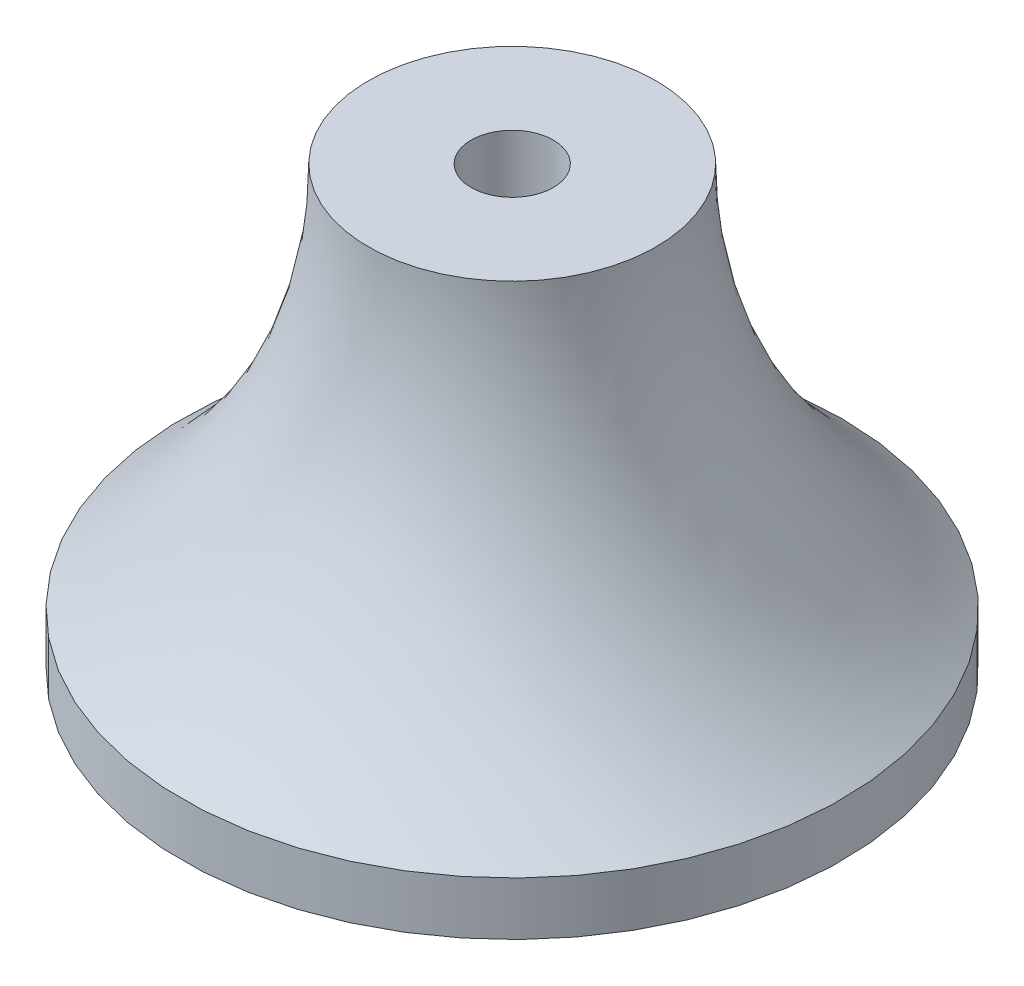
ISO-10303-21;
HEADER;
FILE_DESCRIPTION(('STEP AP214'),'2;1');
FILE_NAME('part.step','',(''),(''),'','','');
FILE_SCHEMA(('AUTOMOTIVE_DESIGN { 1 0 10303 214 1 1 1 1 }'));
ENDSEC;
DATA;
#1=APPLICATION_CONTEXT('core data for automotive mechanical design processes');
#2=APPLICATION_PROTOCOL_DEFINITION('international standard','automotive_design',2000,#1);
#3=PRODUCT_CONTEXT('',#1,'mechanical');
#4=PRODUCT('Part','Part','',(#3));
#5=PRODUCT_RELATED_PRODUCT_CATEGORY('part','',(#4));
#6=PRODUCT_DEFINITION_FORMATION('','',#4);
#7=PRODUCT_DEFINITION_CONTEXT('part definition',#1,'design');
#8=PRODUCT_DEFINITION('design','',#6,#7);
#9=PRODUCT_DEFINITION_SHAPE('','',#8);
#10=(LENGTH_UNIT() NAMED_UNIT(*) SI_UNIT(.MILLI.,.METRE.));
#11=(NAMED_UNIT(*) PLANE_ANGLE_UNIT() SI_UNIT($,.RADIAN.));
#12=(NAMED_UNIT(*) SI_UNIT($,.STERADIAN.) SOLID_ANGLE_UNIT());
#13=UNCERTAINTY_MEASURE_WITH_UNIT(LENGTH_MEASURE(1.E-05),#10,'distance_accuracy_value','');
#14=(GEOMETRIC_REPRESENTATION_CONTEXT(3) GLOBAL_UNCERTAINTY_ASSIGNED_CONTEXT((#13)) GLOBAL_UNIT_ASSIGNED_CONTEXT((#10,
#11,#12)) REPRESENTATION_CONTEXT('',''));
#15=CARTESIAN_POINT('',(0.,0.,0.));
#16=DIRECTION('',(0.,0.,1.));
#17=DIRECTION('',(1.,0.,0.));
#18=AXIS2_PLACEMENT_3D('',#15,#16,#17);
#19=CARTESIAN_POINT('',(0.,0.,0.));
#20=DIRECTION('',(0.,-1.,0.));
#21=DIRECTION('',(0.,0.,-1.));
#22=AXIS2_PLACEMENT_3D('',#19,#20,#21);
#23=CYLINDRICAL_SURFACE('',#22,2.032);
#24=CARTESIAN_POINT('',(0.,19.05,0.));
#25=DIRECTION('',(0.,-1.,0.));
#26=DIRECTION('',(0.,0.,-1.));
#27=AXIS2_PLACEMENT_3D('',#24,#25,#26);
#28=CIRCLE('',#27,2.032);
#29=CARTESIAN_POINT('',(0.,19.05,-2.032));
#30=VERTEX_POINT('',#29);
#31=EDGE_CURVE('E46',#30,#30,#28,.T.);
#32=ORIENTED_EDGE('',*,*,#31,.F.);
#33=EDGE_LOOP('',(#32));
#34=FACE_BOUND('',#33,.T.);
#35=CARTESIAN_POINT('',(0.,13.462,0.));
#36=DIRECTION('',(0.,-1.,0.));
#37=DIRECTION('',(0.,0.,-1.));
#38=AXIS2_PLACEMENT_3D('',#35,#36,#37);
#39=CIRCLE('',#38,2.032);
#40=CARTESIAN_POINT('',(0.,13.462,-2.032));
#41=VERTEX_POINT('',#40);
#42=EDGE_CURVE('E41',#41,#41,#39,.F.);
#43=ORIENTED_EDGE('',*,*,#42,.F.);
#44=EDGE_LOOP('',(#43));
#45=FACE_BOUND('',#44,.T.);
#46=ADVANCED_FACE('F37',(#34,#45),#23,.F.);
#47=CARTESIAN_POINT('',(0.,19.05,0.));
#48=DIRECTION('',(0.,-1.,0.));
#49=DIRECTION('',(0.,0.,-1.));
#50=AXIS2_PLACEMENT_3D('',#47,#48,#49);
#51=TOROIDAL_SURFACE('',#50,31.4619348413196,24.3499348413196);
#52=CARTESIAN_POINT('',(0.,0.,0.));
#53=DIRECTION('',(0.,-1.,0.));
#54=DIRECTION('',(0.,0.,-1.));
#55=AXIS2_PLACEMENT_3D('',#52,#53,#54);
#56=CIRCLE('',#55,16.2956292009696);
#57=CARTESIAN_POINT('',(0.,0.,-16.2956292009696));
#58=VERTEX_POINT('',#57);
#59=EDGE_CURVE('E139',#58,#58,#56,.T.);
#60=ORIENTED_EDGE('',*,*,#59,.F.);
#61=EDGE_LOOP('',(#60));
#62=FACE_BOUND('',#61,.T.);
#63=CARTESIAN_POINT('',(0.,19.05,0.));
#64=DIRECTION('',(0.,-1.,0.));
#65=DIRECTION('',(0.,0.,-1.));
#66=AXIS2_PLACEMENT_3D('',#63,#64,#65);
#67=CIRCLE('',#66,7.112);
#68=CARTESIAN_POINT('',(0.,19.05,-7.112));
#69=VERTEX_POINT('',#68);
#70=EDGE_CURVE('E12',#69,#69,#67,.T.);
#71=ORIENTED_EDGE('',*,*,#70,.T.);
#72=EDGE_LOOP('',(#71));
#73=FACE_BOUND('',#72,.T.);
#74=ADVANCED_FACE('F39',(#62,#73),#51,.F.);
#75=CARTESIAN_POINT('',(0.,19.05,0.));
#76=DIRECTION('',(0.,-1.,0.));
#77=DIRECTION('',(0.,0.,-1.));
#78=AXIS2_PLACEMENT_3D('',#75,#76,#77);
#79=PLANE('',#78);
#80=ORIENTED_EDGE('',*,*,#70,.F.);
#81=EDGE_LOOP('',(#80));
#82=FACE_BOUND('',#81,.T.);
#83=ORIENTED_EDGE('',*,*,#31,.T.);
#84=EDGE_LOOP('',(#83));
#85=FACE_BOUND('',#84,.T.);
#86=ADVANCED_FACE('F148',(#82,#85),#79,.F.);
#87=CARTESIAN_POINT('',(0.,-2.63421929682295,0.));
#88=DIRECTION('',(0.,-1.,0.));
#89=DIRECTION('',(0.,0.,-1.));
#90=AXIS2_PLACEMENT_3D('',#87,#88,#89);
#91=PLANE('',#90);
#92=DIRECTION('',(0.397934450632884,0.,0.917413850451095));
#93=VECTOR('',#92,1.);
#94=CARTESIAN_POINT('',(2.88200941409084,-2.63421929682295,-3.88758662116894));
#95=LINE('',#94,#93);
#96=CARTESIAN_POINT('',(2.88200941409084,-2.63421929682295,-3.88758662116894));
#97=VERTEX_POINT('',#96);
#98=CARTESIAN_POINT('',(4.80775348039024,-2.63421929682295,0.552100055964106));
#99=VERTEX_POINT('',#98);
#100=EDGE_CURVE('E53',#97,#99,#95,.T.);
#101=ORIENTED_EDGE('',*,*,#100,.F.);
#102=DIRECTION('',(0.993470925590789,0.,0.114085581936465));
#103=VECTOR('',#102,1.);
#104=CARTESIAN_POINT('',(-1.92574406629939,-2.63421929682295,-4.43968667713305));
#105=LINE('',#104,#103);
#106=CARTESIAN_POINT('',(-1.92574406629939,-2.63421929682295,-4.43968667713305));
#107=VERTEX_POINT('',#106);
#108=EDGE_CURVE('E127',#107,#97,#105,.T.);
#109=ORIENTED_EDGE('',*,*,#108,.F.);
#110=DIRECTION('',(0.595536474957904,0.,-0.80332826851463));
#111=VECTOR('',#110,1.);
#112=CARTESIAN_POINT('',(-4.80775348039024,-2.63421929682295,-0.552100055964107));
#113=LINE('',#112,#111);
#114=CARTESIAN_POINT('',(-4.80775348039024,-2.63421929682295,-0.552100055964107));
#115=VERTEX_POINT('',#114);
#116=EDGE_CURVE('E121',#115,#107,#113,.T.);
#117=ORIENTED_EDGE('',*,*,#116,.F.);
#118=DIRECTION('',(-0.397934450632884,0.,-0.917413850451095));
#119=VECTOR('',#118,1.);
#120=CARTESIAN_POINT('',(-2.88200941409084,-2.63421929682295,3.88758662116894));
#121=LINE('',#120,#119);
#122=CARTESIAN_POINT('',(-2.88200941409084,-2.63421929682295,3.88758662116894));
#123=VERTEX_POINT('',#122);
#124=EDGE_CURVE('E119',#123,#115,#121,.T.);
#125=ORIENTED_EDGE('',*,*,#124,.F.);
#126=DIRECTION('',(-0.993470925590788,0.,-0.114085581936466));
#127=VECTOR('',#126,1.);
#128=CARTESIAN_POINT('',(1.92574406629939,-2.63421929682295,4.43968667713305));
#129=LINE('',#128,#127);
#130=CARTESIAN_POINT('',(1.92574406629939,-2.63421929682295,4.43968667713305));
#131=VERTEX_POINT('',#130);
#132=EDGE_CURVE('E104',#131,#123,#129,.T.);
#133=ORIENTED_EDGE('',*,*,#132,.F.);
#134=DIRECTION('',(-0.595536474957904,0.,0.80332826851463));
#135=VECTOR('',#134,1.);
#136=CARTESIAN_POINT('',(4.80775348039024,-2.63421929682295,0.552100055964106));
#137=LINE('',#136,#135);
#138=EDGE_CURVE('E111',#99,#131,#137,.T.);
#139=ORIENTED_EDGE('',*,*,#138,.F.);
#140=EDGE_LOOP('',(#101,#109,#117,#125,#133,#139));
#141=FACE_BOUND('',#140,.T.);
#142=CARTESIAN_POINT('',(0.,-2.63421929682295,0.));
#143=DIRECTION('',(0.,-1.,0.));
#144=DIRECTION('',(0.,0.,-1.));
#145=AXIS2_PLACEMENT_3D('',#142,#143,#144);
#146=CIRCLE('',#145,16.2956292009696);
#147=CARTESIAN_POINT('',(0.,-2.63421929682295,-16.2956292009696));
#148=VERTEX_POINT('',#147);
#149=EDGE_CURVE('E142',#148,#148,#146,.T.);
#150=ORIENTED_EDGE('',*,*,#149,.T.);
#151=EDGE_LOOP('',(#150));
#152=FACE_BOUND('',#151,.T.);
#153=ADVANCED_FACE('F115',(#141,#152),#91,.T.);
#154=CARTESIAN_POINT('',(0.,0.,0.));
#155=DIRECTION('',(0.,-1.,0.));
#156=DIRECTION('',(0.,0.,-1.));
#157=AXIS2_PLACEMENT_3D('',#154,#155,#156);
#158=CYLINDRICAL_SURFACE('',#157,16.2956292009696);
#159=ORIENTED_EDGE('',*,*,#149,.F.);
#160=EDGE_LOOP('',(#159));
#161=FACE_BOUND('',#160,.T.);
#162=ORIENTED_EDGE('',*,*,#59,.T.);
#163=EDGE_LOOP('',(#162));
#164=FACE_BOUND('',#163,.T.);
#165=ADVANCED_FACE('F159',(#161,#164),#158,.T.);
#166=CARTESIAN_POINT('',(0.,13.462,0.));
#167=DIRECTION('',(0.,-1.,0.));
#168=DIRECTION('',(0.,0.,-1.));
#169=AXIS2_PLACEMENT_3D('',#166,#167,#168);
#170=PLANE('',#169);
#171=DIRECTION('',(-0.397934450632884,0.,-0.917413850451095));
#172=VECTOR('',#171,1.);
#173=CARTESIAN_POINT('',(2.88200941409084,13.462,-3.88758662116894));
#174=LINE('',#173,#172);
#175=CARTESIAN_POINT('',(4.80775348039024,13.462,0.552100055964106));
#176=VERTEX_POINT('',#175);
#177=CARTESIAN_POINT('',(2.88200941409084,13.462,-3.88758662116894));
#178=VERTEX_POINT('',#177);
#179=EDGE_CURVE('E72',#176,#178,#174,.T.);
#180=ORIENTED_EDGE('',*,*,#179,.F.);
#181=DIRECTION('',(0.595536474957904,0.,-0.80332826851463));
#182=VECTOR('',#181,1.);
#183=CARTESIAN_POINT('',(4.80775348039024,13.462,0.552100055964106));
#184=LINE('',#183,#182);
#185=CARTESIAN_POINT('',(1.92574406629939,13.462,4.43968667713305));
#186=VERTEX_POINT('',#185);
#187=EDGE_CURVE('E81',#186,#176,#184,.T.);
#188=ORIENTED_EDGE('',*,*,#187,.F.);
#189=DIRECTION('',(0.993470925590789,0.,0.114085581936466));
#190=VECTOR('',#189,1.);
#191=CARTESIAN_POINT('',(1.92574406629939,13.462,4.43968667713305));
#192=LINE('',#191,#190);
#193=CARTESIAN_POINT('',(-2.88200941409084,13.462,3.88758662116894));
#194=VERTEX_POINT('',#193);
#195=EDGE_CURVE('E106',#194,#186,#192,.T.);
#196=ORIENTED_EDGE('',*,*,#195,.F.);
#197=DIRECTION('',(0.397934450632884,0.,0.917413850451095));
#198=VECTOR('',#197,1.);
#199=CARTESIAN_POINT('',(-2.88200941409084,13.462,3.88758662116894));
#200=LINE('',#199,#198);
#201=CARTESIAN_POINT('',(-4.80775348039024,13.462,-0.552100055964108));
#202=VERTEX_POINT('',#201);
#203=EDGE_CURVE('E62',#202,#194,#200,.T.);
#204=ORIENTED_EDGE('',*,*,#203,.F.);
#205=DIRECTION('',(-0.595536474957905,0.,0.80332826851463));
#206=VECTOR('',#205,1.);
#207=CARTESIAN_POINT('',(-4.80775348039024,13.462,-0.552100055964107));
#208=LINE('',#207,#206);
#209=CARTESIAN_POINT('',(-1.92574406629939,13.462,-4.43968667713305));
#210=VERTEX_POINT('',#209);
#211=EDGE_CURVE('E266',#210,#202,#208,.T.);
#212=ORIENTED_EDGE('',*,*,#211,.F.);
#213=DIRECTION('',(-0.993470925590789,0.,-0.114085581936465));
#214=VECTOR('',#213,1.);
#215=CARTESIAN_POINT('',(-1.92574406629939,13.462,-4.43968667713305));
#216=LINE('',#215,#214);
#217=EDGE_CURVE('E267',#178,#210,#216,.T.);
#218=ORIENTED_EDGE('',*,*,#217,.F.);
#219=EDGE_LOOP('',(#180,#188,#196,#204,#212,#218));
#220=FACE_BOUND('',#219,.T.);
#221=ORIENTED_EDGE('',*,*,#42,.T.);
#222=EDGE_LOOP('',(#221));
#223=FACE_BOUND('',#222,.T.);
#224=ADVANCED_FACE('F156',(#220,#223),#170,.T.);
#225=CARTESIAN_POINT('',(2.88200941409084,32.138210163245,-3.88758662116894));
#226=DIRECTION('',(0.917413850451095,0.,-0.397934450632884));
#227=DIRECTION('',(-0.397934450632884,0.,-0.917413850451095));
#228=AXIS2_PLACEMENT_3D('',#225,#226,#227);
#229=PLANE('',#228);
#230=ORIENTED_EDGE('',*,*,#179,.T.);
#231=DIRECTION('',(0.,-1.,0.));
#232=VECTOR('',#231,1.);
#233=CARTESIAN_POINT('',(2.88200941409084,32.138210163245,-3.88758662116894));
#234=LINE('',#233,#232);
#235=EDGE_CURVE('E130',#178,#97,#234,.T.);
#236=ORIENTED_EDGE('',*,*,#235,.T.);
#237=ORIENTED_EDGE('',*,*,#100,.T.);
#238=DIRECTION('',(0.,-1.,0.));
#239=VECTOR('',#238,1.);
#240=CARTESIAN_POINT('',(4.80775348039024,32.138210163245,0.552100055964106));
#241=LINE('',#240,#239);
#242=EDGE_CURVE('E108',#176,#99,#241,.T.);
#243=ORIENTED_EDGE('',*,*,#242,.F.);
#244=EDGE_LOOP('',(#230,#236,#237,#243));
#245=FACE_BOUND('',#244,.T.);
#246=ADVANCED_FACE('F158',(#245),#229,.F.);
#247=CARTESIAN_POINT('',(-1.92574406629939,32.138210163245,-4.43968667713305));
#248=DIRECTION('',(0.114085581936465,0.,-0.993470925590788));
#249=DIRECTION('',(-0.993470925590789,0.,-0.114085581936465));
#250=AXIS2_PLACEMENT_3D('',#247,#248,#249);
#251=PLANE('',#250);
#252=ORIENTED_EDGE('',*,*,#217,.T.);
#253=DIRECTION('',(0.,-1.,0.));
#254=VECTOR('',#253,1.);
#255=CARTESIAN_POINT('',(-1.92574406629939,32.138210163245,-4.43968667713305));
#256=LINE('',#255,#254);
#257=EDGE_CURVE('E132',#210,#107,#256,.T.);
#258=ORIENTED_EDGE('',*,*,#257,.T.);
#259=ORIENTED_EDGE('',*,*,#108,.T.);
#260=ORIENTED_EDGE('',*,*,#235,.F.);
#261=EDGE_LOOP('',(#252,#258,#259,#260));
#262=FACE_BOUND('',#261,.T.);
#263=ADVANCED_FACE('F166',(#262),#251,.F.);
#264=CARTESIAN_POINT('',(-4.80775348039024,32.138210163245,-0.552100055964107));
#265=DIRECTION('',(-0.80332826851463,0.,-0.595536474957904));
#266=DIRECTION('',(-0.595536474957905,0.,0.80332826851463));
#267=AXIS2_PLACEMENT_3D('',#264,#265,#266);
#268=PLANE('',#267);
#269=ORIENTED_EDGE('',*,*,#211,.T.);
#270=DIRECTION('',(0.,-1.,0.));
#271=VECTOR('',#270,1.);
#272=CARTESIAN_POINT('',(-4.80775348039024,32.138210163245,-0.552100055964107));
#273=LINE('',#272,#271);
#274=EDGE_CURVE('E134',#202,#115,#273,.T.);
#275=ORIENTED_EDGE('',*,*,#274,.T.);
#276=ORIENTED_EDGE('',*,*,#116,.T.);
#277=ORIENTED_EDGE('',*,*,#257,.F.);
#278=EDGE_LOOP('',(#269,#275,#276,#277));
#279=FACE_BOUND('',#278,.T.);
#280=ADVANCED_FACE('F173',(#279),#268,.F.);
#281=CARTESIAN_POINT('',(-2.88200941409084,32.138210163245,3.88758662116894));
#282=DIRECTION('',(-0.917413850451095,0.,0.397934450632884));
#283=DIRECTION('',(0.397934450632884,0.,0.917413850451095));
#284=AXIS2_PLACEMENT_3D('',#281,#282,#283);
#285=PLANE('',#284);
#286=ORIENTED_EDGE('',*,*,#203,.T.);
#287=DIRECTION('',(0.,-1.,0.));
#288=VECTOR('',#287,1.);
#289=CARTESIAN_POINT('',(-2.88200941409084,32.138210163245,3.88758662116894));
#290=LINE('',#289,#288);
#291=EDGE_CURVE('E107',#194,#123,#290,.T.);
#292=ORIENTED_EDGE('',*,*,#291,.T.);
#293=ORIENTED_EDGE('',*,*,#124,.T.);
#294=ORIENTED_EDGE('',*,*,#274,.F.);
#295=EDGE_LOOP('',(#286,#292,#293,#294));
#296=FACE_BOUND('',#295,.T.);
#297=ADVANCED_FACE('F177',(#296),#285,.F.);
#298=CARTESIAN_POINT('',(1.92574406629939,32.138210163245,4.43968667713305));
#299=DIRECTION('',(-0.114085581936466,0.,0.993470925590788));
#300=DIRECTION('',(0.993470925590789,0.,0.114085581936466));
#301=AXIS2_PLACEMENT_3D('',#298,#299,#300);
#302=PLANE('',#301);
#303=ORIENTED_EDGE('',*,*,#195,.T.);
#304=DIRECTION('',(0.,-1.,0.));
#305=VECTOR('',#304,1.);
#306=CARTESIAN_POINT('',(1.92574406629939,32.138210163245,4.43968667713305));
#307=LINE('',#306,#305);
#308=EDGE_CURVE('E99',#186,#131,#307,.T.);
#309=ORIENTED_EDGE('',*,*,#308,.T.);
#310=ORIENTED_EDGE('',*,*,#132,.T.);
#311=ORIENTED_EDGE('',*,*,#291,.F.);
#312=EDGE_LOOP('',(#303,#309,#310,#311));
#313=FACE_BOUND('',#312,.T.);
#314=ADVANCED_FACE('F101',(#313),#302,.F.);
#315=CARTESIAN_POINT('',(4.80775348039024,32.138210163245,0.552100055964106));
#316=DIRECTION('',(0.80332826851463,0.,0.595536474957904));
#317=DIRECTION('',(0.595536474957904,0.,-0.80332826851463));
#318=AXIS2_PLACEMENT_3D('',#315,#316,#317);
#319=PLANE('',#318);
#320=ORIENTED_EDGE('',*,*,#187,.T.);
#321=ORIENTED_EDGE('',*,*,#242,.T.);
#322=ORIENTED_EDGE('',*,*,#138,.T.);
#323=ORIENTED_EDGE('',*,*,#308,.F.);
#324=EDGE_LOOP('',(#320,#321,#322,#323));
#325=FACE_BOUND('',#324,.T.);
#326=ADVANCED_FACE('F112',(#325),#319,.F.);
#327=CLOSED_SHELL('',(#46,#74,#86,#153,#165,#224,#246,#263,#280,#297,#314,#326));
#328=MANIFOLD_SOLID_BREP('B2',#327);
#329=ADVANCED_BREP_SHAPE_REPRESENTATION('',(#18,#328),#14);
#330=SHAPE_DEFINITION_REPRESENTATION(#9,#329);
ENDSEC;
END-ISO-10303-21;
